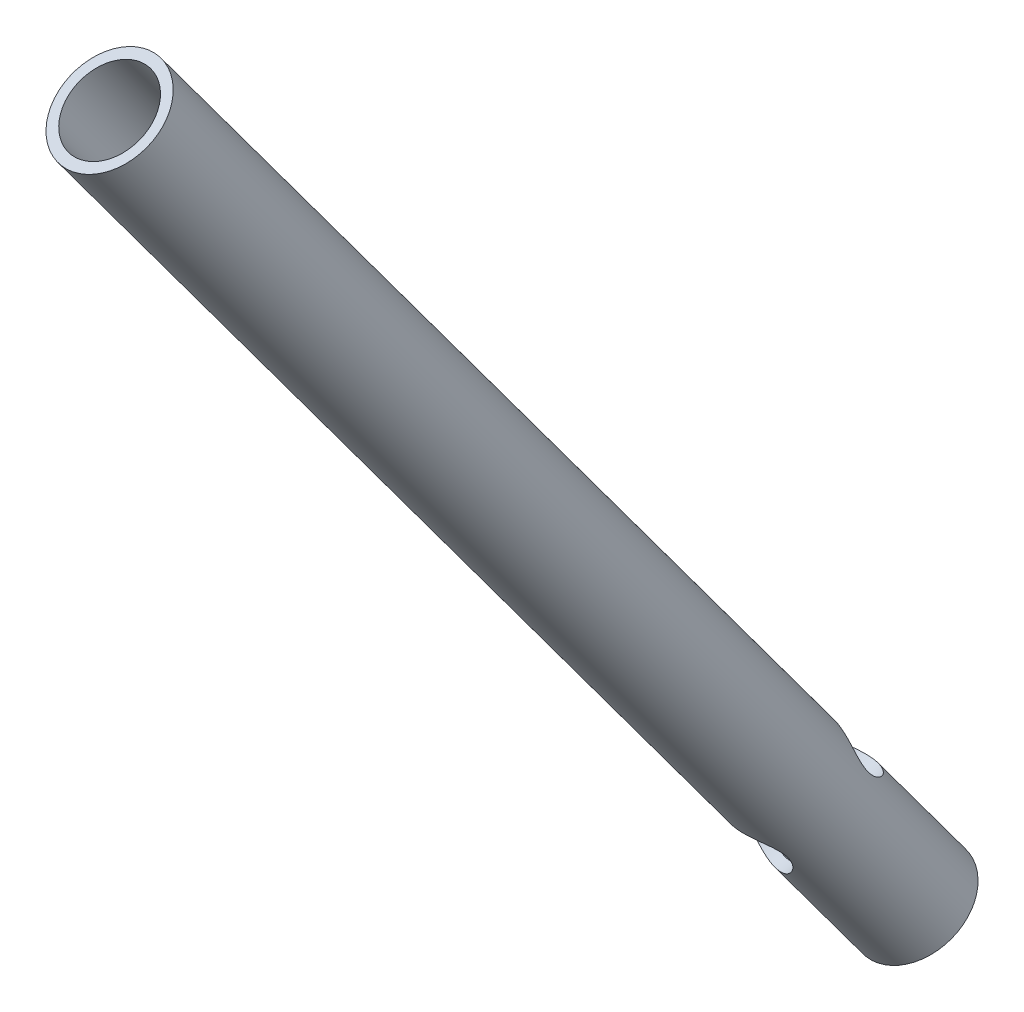
ISO-10303-21;
HEADER;
FILE_DESCRIPTION(('STEP AP214'),'2;1');
FILE_NAME('part.step','',(''),(''),'','','');
FILE_SCHEMA(('AUTOMOTIVE_DESIGN { 1 0 10303 214 1 1 1 1 }'));
ENDSEC;
DATA;
#1=APPLICATION_CONTEXT('core data for automotive mechanical design processes');
#2=APPLICATION_PROTOCOL_DEFINITION('international standard','automotive_design',2000,#1);
#3=PRODUCT_CONTEXT('',#1,'mechanical');
#4=PRODUCT('Part','Part','',(#3));
#5=PRODUCT_RELATED_PRODUCT_CATEGORY('part','',(#4));
#6=PRODUCT_DEFINITION_FORMATION('','',#4);
#7=PRODUCT_DEFINITION_CONTEXT('part definition',#1,'design');
#8=PRODUCT_DEFINITION('design','',#6,#7);
#9=PRODUCT_DEFINITION_SHAPE('','',#8);
#10=(LENGTH_UNIT() NAMED_UNIT(*) SI_UNIT(.MILLI.,.METRE.));
#11=(NAMED_UNIT(*) PLANE_ANGLE_UNIT() SI_UNIT($,.RADIAN.));
#12=(NAMED_UNIT(*) SI_UNIT($,.STERADIAN.) SOLID_ANGLE_UNIT());
#13=UNCERTAINTY_MEASURE_WITH_UNIT(LENGTH_MEASURE(1.E-05),#10,'distance_accuracy_value','');
#14=(GEOMETRIC_REPRESENTATION_CONTEXT(3) GLOBAL_UNCERTAINTY_ASSIGNED_CONTEXT((#13)) GLOBAL_UNIT_ASSIGNED_CONTEXT((#10,
#11,#12)) REPRESENTATION_CONTEXT('',''));
#15=CARTESIAN_POINT('',(0.,0.,0.));
#16=DIRECTION('',(0.,0.,1.));
#17=DIRECTION('',(1.,0.,0.));
#18=AXIS2_PLACEMENT_3D('',#15,#16,#17);
#19=CARTESIAN_POINT('',(63.0987415441482,49.4332995604528,122.83463270836));
#20=DIRECTION('',(-0.139606325522582,0.812953742443683,0.565346165212866));
#21=DIRECTION('',(0.,-0.57093730493495,0.820993662480787));
#22=AXIS2_PLACEMENT_3D('',#19,#20,#21);
#23=CYLINDRICAL_SURFACE('',#22,4.99999999999987);
#24=CARTESIAN_POINT('',(61.404673387767,56.4434887319872,133.799855613343));
#25=CARTESIAN_POINT('',(61.4828311919621,56.4734045881373,133.820659307766));
#26=CARTESIAN_POINT('',(61.5595057263382,56.5071017751196,133.84160121947));
#27=CARTESIAN_POINT('',(61.7093230524704,56.5814728077361,133.883786797185));
#28=CARTESIAN_POINT('',(61.782463968274,56.6221503080855,133.905030615897));
#29=CARTESIAN_POINT('',(61.9958000801327,56.7537121038821,133.969311099277));
#30=CARTESIAN_POINT('',(62.1300373785675,56.8541762756493,134.012930412775));
#31=CARTESIAN_POINT('',(62.3786503777988,57.0747367601084,134.102661861588));
#32=CARTESIAN_POINT('',(62.4931269495329,57.1947269014572,134.148759659744));
#33=CARTESIAN_POINT('',(62.7010789886567,57.4501472951768,134.245845167595));
#34=CARTESIAN_POINT('',(62.7945353431299,57.5855914320175,134.296837267886));
#35=CARTESIAN_POINT('',(62.9648642164375,57.8792424630439,134.411131033619));
#36=CARTESIAN_POINT('',(63.0396530525655,58.0384056169722,134.475110463413));
#37=CARTESIAN_POINT('',(63.157360684921,58.3625861834085,134.616088207033));
#38=CARTESIAN_POINT('',(63.2003473217564,58.5275903427886,134.693058375357));
#39=CARTESIAN_POINT('',(63.2437573350844,58.813021332251,134.841129762973));
#40=CARTESIAN_POINT('',(63.2522543212032,58.9340567375037,134.908697938559));
#41=CARTESIAN_POINT('',(63.2479757746082,59.1704837093475,135.052404422043));
#42=CARTESIAN_POINT('',(63.235221895459,59.2858808976982,135.128533932679));
#43=CARTESIAN_POINT('',(63.1885481595445,59.507401483483,135.287558283054));
#44=CARTESIAN_POINT('',(63.1546194008969,59.6135209591809,135.37045595537));
#45=CARTESIAN_POINT('',(63.0671517688983,59.8142048125803,135.539851190516));
#46=CARTESIAN_POINT('',(63.013596620492,59.9087595132257,135.626351688048));
#47=CARTESIAN_POINT('',(62.888078433766,60.0873320670051,135.800956127248));
#48=CARTESIAN_POINT('',(62.8157847733765,60.1711154083576,135.889059286522));
#49=CARTESIAN_POINT('',(62.6558025981993,60.3266478861921,136.061763788559));
#50=CARTESIAN_POINT('',(62.5681078172049,60.3983921010282,136.146363688581));
#51=CARTESIAN_POINT('',(62.3616480913652,60.5433721581661,136.324305822117));
#52=CARTESIAN_POINT('',(62.2401409253603,60.6143596739452,136.416307827502));
#53=CARTESIAN_POINT('',(61.9811240406226,60.7425275873673,136.586516239286));
#54=CARTESIAN_POINT('',(61.8435993884714,60.7996949450242,136.66470959796));
#55=CARTESIAN_POINT('',(61.5387739793861,60.9069571586091,136.810589584585));
#56=CARTESIAN_POINT('',(61.369863827551,60.9555350748461,136.876107729713));
#57=CARTESIAN_POINT('',(61.1076898163129,61.0167669103574,136.952764957039));
#58=CARTESIAN_POINT('',(61.0188011402721,61.0352423094892,136.974717518506));
#59=CARTESIAN_POINT('',(60.8387542406441,61.0683089268934,137.010752942468));
#60=CARTESIAN_POINT('',(60.747597539645,61.0829026779789,137.024840943293));
#61=CARTESIAN_POINT('',(60.5719017918832,61.1070598201668,137.043684875066));
#62=CARTESIAN_POINT('',(60.4874834834779,61.116952127489,137.049150869258));
#63=CARTESIAN_POINT('',(60.318208390448,61.1334299891546,137.052691228706));
#64=CARTESIAN_POINT('',(60.2333518779046,61.1400173925551,137.050769732407));
#65=CARTESIAN_POINT('',(60.0639973508861,61.1498534294813,137.039330855457));
#66=CARTESIAN_POINT('',(59.9794991576083,61.1531039898482,137.02981786412));
#67=CARTESIAN_POINT('',(59.8116780703698,61.1562562503289,137.003178131858));
#68=CARTESIAN_POINT('',(59.7283550463795,61.1561583238989,136.986052240209));
#69=CARTESIAN_POINT('',(59.5024133838283,61.1512886764345,136.928746106677));
#70=CARTESIAN_POINT('',(59.3617248873426,61.1430992010815,136.880890383541));
#71=CARTESIAN_POINT('',(59.0903999284307,61.1167122909284,136.764340861151));
#72=CARTESIAN_POINT('',(58.9597640068326,61.0985143181001,136.695645941731));
#73=CARTESIAN_POINT('',(58.7115637548257,61.0524491227678,136.540728363316));
#74=CARTESIAN_POINT('',(58.5939801482373,61.0245964164981,136.454532098362));
#75=CARTESIAN_POINT('',(58.3734313062693,60.9594304156756,136.268235572717));
#76=CARTESIAN_POINT('',(58.2704696129242,60.9221148348993,136.168131954666));
#77=CARTESIAN_POINT('',(58.0690045499671,60.8330835747857,135.945509670682));
#78=CARTESIAN_POINT('',(57.9724044584327,60.7801994687877,135.821737872367));
#79=CARTESIAN_POINT('',(57.7990191507332,60.6618951434585,135.566355958226));
#80=CARTESIAN_POINT('',(57.7222603460097,60.5964584145654,135.434735678738));
#81=CARTESIAN_POINT('',(57.5810904743679,60.4430970414093,135.152702560596));
#82=CARTESIAN_POINT('',(57.519272159567,60.3534148831814,135.001932319415));
#83=CARTESIAN_POINT('',(57.4223679917548,60.1544116207943,134.70485862279));
#84=CARTESIAN_POINT('',(57.3872380242176,60.0451232960129,134.558548181554));
#85=CARTESIAN_POINT('',(57.3502801035109,59.8344024067716,134.313387786523));
#86=CARTESIAN_POINT('',(57.3424616852154,59.7374380628691,134.211604863932));
#87=CARTESIAN_POINT('',(57.3436256163065,59.5321272950668,134.020442830854));
#88=CARTESIAN_POINT('',(57.3525871708231,59.42379511599,133.931048515012));
#89=CARTESIAN_POINT('',(57.3872534255522,59.197960872408,133.768035566651));
#90=CARTESIAN_POINT('',(57.4129910058861,59.0804411998142,133.694448292462));
#91=CARTESIAN_POINT('',(57.4803524992924,58.8403283596838,133.564873277239));
#92=CARTESIAN_POINT('',(57.5219882940875,58.717731458863,133.508898756519));
#93=CARTESIAN_POINT('',(57.6191123010293,58.4734540166422,133.41465098179));
#94=CARTESIAN_POINT('',(57.6744119174066,58.3517825073275,133.376155464376));
#95=CARTESIAN_POINT('',(57.7978686520831,58.1112881462758,133.313893343971));
#96=CARTESIAN_POINT('',(57.866030502835,57.9924663612434,133.290132176083));
#97=CARTESIAN_POINT('',(58.0272500609092,57.7402997831778,133.25202602937));
#98=CARTESIAN_POINT('',(58.1225768108131,57.6080453311155,133.24005194673));
#99=CARTESIAN_POINT('',(58.3286578776207,57.3554918836612,133.229935517004));
#100=CARTESIAN_POINT('',(58.4394269142802,57.2352044851063,133.231806456824));
#101=CARTESIAN_POINT('',(58.6921598863505,56.994800166459,133.247658685118));
#102=CARTESIAN_POINT('',(58.8363199213352,56.8770483585514,133.263293132649));
#103=CARTESIAN_POINT('',(59.0650687097398,56.7207298513272,133.294965426777));
#104=CARTESIAN_POINT('',(59.1434396207924,56.671991906227,133.306899889318));
#105=CARTESIAN_POINT('',(59.3039910836638,56.5820450536091,133.333147913492));
#106=CARTESIAN_POINT('',(59.3861692518347,56.5408315129874,133.347460000677));
#107=CARTESIAN_POINT('',(59.5485869544735,56.4690089463669,133.377150446031));
#108=CARTESIAN_POINT('',(59.6286273950489,56.4378986200845,133.392406512741));
#109=CARTESIAN_POINT('',(59.7910113144472,56.3835524455576,133.424408464987));
#110=CARTESIAN_POINT('',(59.87335348508,56.3603122190285,133.441153515605));
#111=CARTESIAN_POINT('',(60.0396498016595,56.3221772097682,133.475858425569));
#112=CARTESIAN_POINT('',(60.1236029543168,56.3072774453459,133.493817552558));
#113=CARTESIAN_POINT('',(60.2923842450794,56.286137721092,133.530704056181));
#114=CARTESIAN_POINT('',(60.377212335932,56.2798972960374,133.549631380742));
#115=CARTESIAN_POINT('',(60.542477938089,56.2763228489257,133.58722032221));
#116=CARTESIAN_POINT('',(60.6229145760324,56.2785429254547,133.605844650097));
#117=CARTESIAN_POINT('',(60.7830966049335,56.290867993634,133.643598610951));
#118=CARTESIAN_POINT('',(60.8628416983181,56.3009762243926,133.662728448378));
#119=CARTESIAN_POINT('',(61.0208728698429,56.3288876441332,133.701355817054));
#120=CARTESIAN_POINT('',(61.0991590439851,56.3466903249149,133.720853323939));
#121=CARTESIAN_POINT('',(61.2536419559188,56.3896668247694,133.760143421736));
#122=CARTESIAN_POINT('',(61.3298376017036,56.4148444189361,133.779936158834));
#123=CARTESIAN_POINT('',(61.404673387767,56.4434887319872,133.799855613343));
#124=B_SPLINE_CURVE_WITH_KNOTS('',3,(#24,#25,#26,#27,#28,#29,#30,#31,#32,#33,#34,#35,#36,#37,
#38,#39,#40,#41,#42,#43,#44,#45,#46,#47,#48,#49,#50,#51,#52,#53,#54,#55,#56,#57,#58,#59,#60,#61,
#62,#63,#64,#65,#66,#67,#68,#69,#70,#71,#72,#73,#74,#75,#76,#77,#78,#79,#80,#81,#82,#83,#84,#85,
#86,#87,#88,#89,#90,#91,#92,#93,#94,#95,#96,#97,#98,#99,#100,#101,#102,#103,#104,#105,#106,#107,
#108,#109,#110,#111,#112,#113,#114,#115,#116,#117,#118,#119,#120,#121,#122,#123),.UNSPECIFIED.,
.T.,.F.,(4,2,2,2,2,2,2,2,2,2,2,2,2,2,2,2,2,2,2,2,2,2,2,2,2,2,2,2,2,2,2,2,2,2,2,2,2,2,2,2,2,2,2,
2,2,2,2,2,2,4),(0.,0.258608279320157,0.517352374822459,1.03441949641947,1.54876367903651,
2.06357366224549,2.62212401424208,3.17947940086457,3.59429850369999,4.00869518512631,
4.42326619565079,4.83818176726183,5.26098594445673,5.68396254691969,6.1863428923063,
6.68919542370325,7.24856231562204,7.52842104361065,7.80809671056417,8.0632450002572,
8.31825037767569,8.57310842071175,8.82793803956181,9.27206020759358,9.71620625269517,
10.1596873844139,10.6032757630952,11.0983307210873,11.5940413096564,12.1493289033721,
12.7036966248454,13.124290136664,13.5443627656778,13.9652612005274,14.3864748165507,
14.8021709856753,15.2180204028114,15.7065350232686,16.1955185262623,16.7527225859344,
17.0315653949404,17.3102359249012,17.5715146474802,17.8326477760792,18.0936247650699,
18.3545877325269,18.6019919214398,18.8494977552841,19.0969872444468,19.3446036413598),.UNSPECIFIED.);
#125=CARTESIAN_POINT('',(61.404673387767,56.4434887319872,133.799855613343));
#126=VERTEX_POINT('',#125);
#127=EDGE_CURVE('E78',#126,#126,#124,.T.);
#128=ORIENTED_EDGE('',*,*,#127,.F.);
#129=EDGE_LOOP('',(#128));
#130=FACE_BOUND('',#129,.T.);
#131=CARTESIAN_POINT('',(61.881311059723,62.1091070245296,125.586073018601));
#132=CARTESIAN_POINT('',(61.8008724196494,62.113523137182,125.580053520732));
#133=CARTESIAN_POINT('',(61.7202314282759,62.1194477503574,125.577465026201));
#134=CARTESIAN_POINT('',(61.5592706168169,62.1342813586015,125.578981331433));
#135=CARTESIAN_POINT('',(61.4789510636016,62.1431924572031,125.583090856857));
#136=CARTESIAN_POINT('',(61.2390848714326,62.1744093759507,125.605122458262));
#137=CARTESIAN_POINT('',(61.0809024021429,62.2011839926366,125.63276612043));
#138=CARTESIAN_POINT('',(60.7739400841279,62.2661552197122,125.710403751037));
#139=CARTESIAN_POINT('',(60.6251061342224,62.3042769883001,125.760252301796));
#140=CARTESIAN_POINT('',(60.3386978614518,62.3921419678891,125.878406687382));
#141=CARTESIAN_POINT('',(60.2011229131129,62.4418845327249,125.946711495996));
#142=CARTESIAN_POINT('',(59.9265723053289,62.559249126142,126.105436954107));
#143=CARTESIAN_POINT('',(59.7910310020665,62.6281613022679,126.197385741739));
#144=CARTESIAN_POINT('',(59.5396344979326,62.7825491147967,126.393617547596));
#145=CARTESIAN_POINT('',(59.4237790283807,62.8680245251036,126.497900397448));
#146=CARTESIAN_POINT('',(59.2302965251827,63.0443179462219,126.697833844869));
#147=CARTESIAN_POINT('',(59.1495851698552,63.1326967600442,126.792637820258));
#148=CARTESIAN_POINT('',(59.0087311778158,63.324118364188,126.982669001316));
#149=CARTESIAN_POINT('',(58.9485613818948,63.4271415349189,127.077895478196));
#150=CARTESIAN_POINT('',(58.8515222519649,63.6480847290794,127.264785340055));
#151=CARTESIAN_POINT('',(58.8148181612262,63.7661035317424,127.356419281124));
#152=CARTESIAN_POINT('',(58.7674936525011,64.0132177659469,127.53108435887));
#153=CARTESIAN_POINT('',(58.7568682527375,64.1423110770628,127.614117135713));
#154=CARTESIAN_POINT('',(58.7612168285694,64.3917641889488,127.760860703859));
#155=CARTESIAN_POINT('',(58.773517368464,64.5115343731607,127.825691555835));
#156=CARTESIAN_POINT('',(58.8172067621712,64.7517966611108,127.946982174999));
#157=CARTESIAN_POINT('',(58.8486044554997,64.8722890735593,128.003438050594));
#158=CARTESIAN_POINT('',(58.9327263444859,65.1225356098714,128.114403370929));
#159=CARTESIAN_POINT('',(58.9872713620002,65.2520088591187,128.168151721914));
#160=CARTESIAN_POINT('',(59.115128367688,65.5041155570103,128.268985481622));
#161=CARTESIAN_POINT('',(59.1884532015189,65.6267442536789,128.316066295288));
#162=CARTESIAN_POINT('',(59.3676301216926,65.8843021563128,128.414060391438));
#163=CARTESIAN_POINT('',(59.4770135428551,66.0171548238435,128.464007661423));
#164=CARTESIAN_POINT('',(59.7174747067011,66.2635276342927,128.560098432386));
#165=CARTESIAN_POINT('',(59.8485630963128,66.3770382336308,128.606240049856));
#166=CARTESIAN_POINT('',(60.0611257249374,66.5299001164709,128.674538897579));
#167=CARTESIAN_POINT('',(60.1358162336042,66.5785128854679,128.697471859001));
#168=CARTESIAN_POINT('',(60.2896266149781,66.6683289226422,128.742935162468));
#169=CARTESIAN_POINT('',(60.3687441983748,66.7095359748379,128.765465704803));
#170=CARTESIAN_POINT('',(60.5307366121174,66.783767263674,128.810187214914));
#171=CARTESIAN_POINT('',(60.6136080758997,66.8167986670284,128.832378463985));
#172=CARTESIAN_POINT('',(60.7824234476615,66.87404916531,128.87643871763));
#173=CARTESIAN_POINT('',(60.8683667654497,66.8982699431223,128.898307782977));
#174=CARTESIAN_POINT('',(61.0309948101604,66.934791051015,128.938792441568));
#175=CARTESIAN_POINT('',(61.107410718548,66.9482401588824,128.957457669242));
#176=CARTESIAN_POINT('',(61.2612978942669,66.9678577857926,128.994396251112));
#177=CARTESIAN_POINT('',(61.338769507877,66.9740238548219,129.012669471408));
#178=CARTESIAN_POINT('',(61.4940153567944,66.9789520340745,129.048670955705));
#179=CARTESIAN_POINT('',(61.5717893123395,66.9777198558885,129.066399629481));
#180=CARTESIAN_POINT('',(61.727036895818,66.9679081302328,129.101165068672));
#181=CARTESIAN_POINT('',(61.8045104030238,66.9593258857867,129.118201577705));
#182=CARTESIAN_POINT('',(62.0219366804173,66.9249080379183,129.165071745163));
#183=CARTESIAN_POINT('',(62.1608605018996,66.8906871591935,129.193904153005));
#184=CARTESIAN_POINT('',(62.4320750073575,66.8002929480787,129.247396243387));
#185=CARTESIAN_POINT('',(62.5643648781663,66.7441169318885,129.272055415263));
#186=CARTESIAN_POINT('',(62.8269974788155,66.6090166276107,129.317096939597));
#187=CARTESIAN_POINT('',(62.9568367344637,66.5290149385538,129.337171082477));
#188=CARTESIAN_POINT('',(63.2048009925733,66.3512488848097,129.369555440143));
#189=CARTESIAN_POINT('',(63.3229180095437,66.2534725382399,129.381860392541));
#190=CARTESIAN_POINT('',(63.5615438958717,66.0293389060809,129.397808475496));
#191=CARTESIAN_POINT('',(63.6801975599911,65.9009033663516,129.400047700798));
#192=CARTESIAN_POINT('',(63.8999090492692,65.630313448841,129.388621234006));
#193=CARTESIAN_POINT('',(64.0009621989556,65.4881554413074,129.374951323129));
#194=CARTESIAN_POINT('',(64.1751355915328,65.2095496306107,129.329867620391));
#195=CARTESIAN_POINT('',(64.2500227026908,65.0739073980365,129.300323908769));
#196=CARTESIAN_POINT('',(64.3828799833466,64.799960030152,129.221567270284));
#197=CARTESIAN_POINT('',(64.4408696161183,64.6616581557299,129.172377129192));
#198=CARTESIAN_POINT('',(64.5139341800725,64.4558782479964,129.082023439526));
#199=CARTESIAN_POINT('',(64.5360406024137,64.3872406625383,129.048946206757));
#200=CARTESIAN_POINT('',(64.5752371637145,64.2514737254469,128.977225531349));
#201=CARTESIAN_POINT('',(64.5923298222333,64.1843436319726,128.938584899081));
#202=CARTESIAN_POINT('',(64.621302367269,64.052343285573,128.855907644814));
#203=CARTESIAN_POINT('',(64.6331837867728,63.9874723732421,128.811872614563));
#204=CARTESIAN_POINT('',(64.6516246919804,63.8606355697822,128.718830573558));
#205=CARTESIAN_POINT('',(64.6581846561562,63.7986694179474,128.669824010259));
#206=CARTESIAN_POINT('',(64.6687649879515,63.6340922139418,128.529968472966));
#207=CARTESIAN_POINT('',(64.6674372898349,63.534825384646,128.434686105201));
#208=CARTESIAN_POINT('',(64.6490271328631,63.3478419489293,128.234901339228));
#209=CARTESIAN_POINT('',(64.6319364396653,63.2601314067033,128.130394147921));
#210=CARTESIAN_POINT('',(64.5808859121334,63.0901366562365,127.908450049815));
#211=CARTESIAN_POINT('',(64.5457939853606,63.0087055154404,127.790624887154));
#212=CARTESIAN_POINT('',(64.4589995905014,62.8578709560249,127.55342267286));
#213=CARTESIAN_POINT('',(64.4072875248188,62.7884745227984,127.43404476288));
#214=CARTESIAN_POINT('',(64.2761125836219,62.6480950122376,127.174565458231));
#215=CARTESIAN_POINT('',(64.193210254821,62.5794226438464,127.034943399568));
#216=CARTESIAN_POINT('',(64.0047758860728,62.4560314739547,126.764798677052));
#217=CARTESIAN_POINT('',(63.8992288199598,62.4013219907196,126.634282131841));
#218=CARTESIAN_POINT('',(63.7215674615834,62.3280398495659,126.446776813718));
#219=CARTESIAN_POINT('',(63.6572298035963,62.304609024397,126.384191998548));
#220=CARTESIAN_POINT('',(63.5227632263208,62.2614638727826,126.264199158593));
#221=CARTESIAN_POINT('',(63.4526371836674,62.2417477160725,126.206788591702));
#222=CARTESIAN_POINT('',(63.3069638265701,62.2060665125806,126.098080243811));
#223=CARTESIAN_POINT('',(63.2314199719466,62.190099099208,126.046778616358));
#224=CARTESIAN_POINT('',(63.0754182164181,62.1619653285236,125.951145552333));
#225=CARTESIAN_POINT('',(62.9949619269647,62.1497977326616,125.906811846913));
#226=CARTESIAN_POINT('',(62.7819088171223,62.1234030046053,125.802477474536));
#227=CARTESIAN_POINT('',(62.646060855366,62.1120524941007,125.748238515618));
#228=CARTESIAN_POINT('',(62.3674030421206,62.0992563034031,125.661633948426));
#229=CARTESIAN_POINT('',(62.224611544358,62.0977858032859,125.62921371327));
#230=CARTESIAN_POINT('',(62.047428965599,62.102034394276,125.603234377735));
#231=CARTESIAN_POINT('',(62.0142785365967,62.1030872455637,125.598978917748));
#232=CARTESIAN_POINT('',(61.9478673092555,62.1057096128194,125.591644087762));
#233=CARTESIAN_POINT('',(61.9146065191996,62.1072790908434,125.588564631428));
#234=CARTESIAN_POINT('',(61.881311059723,62.1091070245296,125.586073018601));
#235=B_SPLINE_CURVE_WITH_KNOTS('',3,(#131,#132,#133,#134,#135,#136,#137,#138,#139,#140,#141,
#142,#143,#144,#145,#146,#147,#148,#149,#150,#151,#152,#153,#154,#155,#156,#157,#158,#159,#160,
#161,#162,#163,#164,#165,#166,#167,#168,#169,#170,#171,#172,#173,#174,#175,#176,#177,#178,#179,
#180,#181,#182,#183,#184,#185,#186,#187,#188,#189,#190,#191,#192,#193,#194,#195,#196,#197,#198,
#199,#200,#201,#202,#203,#204,#205,#206,#207,#208,#209,#210,#211,#212,#213,#214,#215,#216,#217,
#218,#219,#220,#221,#222,#223,#224,#225,#226,#227,#228,#229,#230,#231,#232,#233,#234),
.UNSPECIFIED.,.T.,.F.,(4,2,2,2,2,2,2,2,2,2,2,2,2,2,2,2,2,2,2,2,2,2,2,2,2,2,2,2,2,2,2,2,2,2,2,2,
2,2,2,2,2,2,2,2,2,2,2,2,2,2,2,4),(0.,0.242310536884075,0.484792105308223,0.97056184619206,
1.45319605841304,1.93580344052283,2.46664885901317,2.99748703172212,3.45371974236227,
3.90934688321991,4.36814815875293,4.8268617832737,5.23539149385452,5.64411044499283,
6.09375966965053,6.54371728593869,7.07899264158515,7.61453134774375,7.89025557154334,
8.16583850849858,8.44117900902505,8.71646689013167,8.95555091031055,9.1947153354439,
9.43369514474742,9.672762681044,10.1084883994221,10.5442673976635,11.00391380904,
11.4638712244673,11.9863179207073,12.508903190837,12.9802778147792,13.4511073223577,
13.688799085092,13.9263711954964,14.1638733725166,14.4013541924573,14.812163775326,
15.2231880803317,15.6639805945434,16.1050281110009,16.6317556187037,17.1588337292794,
17.436791318624,17.7146115944919,17.9922560072703,18.269809827191,18.7078367817332,
19.1447629404624,19.2450683796274,19.345366453466),.UNSPECIFIED.);
#236=CARTESIAN_POINT('',(61.881311059723,62.1091070245296,125.586073018601));
#237=VERTEX_POINT('',#236);
#238=EDGE_CURVE('E73',#237,#237,#235,.T.);
#239=ORIENTED_EDGE('',*,*,#238,.F.);
#240=EDGE_LOOP('',(#239));
#241=FACE_BOUND('',#240,.T.);
#242=CARTESIAN_POINT('',(63.0987415441482,49.4332995604528,122.83463270836));
#243=DIRECTION('',(-0.139606325522582,0.812953742443683,0.565346165212866));
#244=DIRECTION('',(0.,-0.57093730493495,0.820993662480786));
#245=AXIS2_PLACEMENT_3D('',#242,#243,#244);
#246=CIRCLE('',#245,4.99999999999987);
#247=CARTESIAN_POINT('',(63.0987415441482,46.5786130357781,126.939601020764));
#248=VERTEX_POINT('',#247);
#249=EDGE_CURVE('E10',#248,#248,#246,.T.);
#250=ORIENTED_EDGE('',*,*,#249,.T.);
#251=EDGE_LOOP('',(#250));
#252=FACE_BOUND('',#251,.T.);
#253=CARTESIAN_POINT('',(47.7420457366642,138.858211229258,185.022710881776));
#254=DIRECTION('',(-0.139606325522582,0.812953742443683,0.565346165212866));
#255=DIRECTION('',(0.,-0.57093730493495,0.820993662480786));
#256=AXIS2_PLACEMENT_3D('',#253,#254,#255);
#257=CIRCLE('',#256,4.99999999999987);
#258=CARTESIAN_POINT('',(47.7420457366642,136.003524704583,189.127679194179));
#259=VERTEX_POINT('',#258);
#260=EDGE_CURVE('E51',#259,#259,#257,.T.);
#261=ORIENTED_EDGE('',*,*,#260,.F.);
#262=EDGE_LOOP('',(#261));
#263=FACE_BOUND('',#262,.T.);
#264=ADVANCED_FACE('F33',(#130,#241,#252,#263),#23,.T.);
#265=CARTESIAN_POINT('',(63.0987415441482,49.4332995604528,122.83463270836));
#266=DIRECTION('',(-0.139606325522582,0.812953742443683,0.565346165212866));
#267=DIRECTION('',(0.,-0.57093730493495,0.820993662480786));
#268=AXIS2_PLACEMENT_3D('',#265,#266,#267);
#269=PLANE('',#268);
#270=CARTESIAN_POINT('',(63.0987415441482,49.4332995604528,122.83463270836));
#271=DIRECTION('',(-0.139606325522582,0.812953742443683,0.565346165212866));
#272=DIRECTION('',(0.,-0.57093730493495,0.820993662480786));
#273=AXIS2_PLACEMENT_3D('',#270,#271,#272);
#274=CIRCLE('',#273,4.);
#275=CARTESIAN_POINT('',(63.0987415441482,47.149550340713,126.118607358283));
#276=VERTEX_POINT('',#275);
#277=EDGE_CURVE('E46',#276,#276,#274,.T.);
#278=ORIENTED_EDGE('',*,*,#277,.T.);
#279=EDGE_LOOP('',(#278));
#280=FACE_BOUND('',#279,.T.);
#281=ORIENTED_EDGE('',*,*,#249,.F.);
#282=EDGE_LOOP('',(#281));
#283=FACE_BOUND('',#282,.T.);
#284=ADVANCED_FACE('F92',(#280,#283),#269,.F.);
#285=CARTESIAN_POINT('',(63.0987415441482,49.4332995604528,122.83463270836));
#286=DIRECTION('',(-0.139606325522582,0.812953742443683,0.565346165212866));
#287=DIRECTION('',(0.,-0.57093730493495,0.820993662480787));
#288=AXIS2_PLACEMENT_3D('',#285,#286,#287);
#289=CYLINDRICAL_SURFACE('',#288,4.);
#290=CARTESIAN_POINT('',(61.4115385942,56.9744486559441,132.951060788445));
#291=CARTESIAN_POINT('',(61.4889556001863,56.9995174489946,132.968490207977));
#292=CARTESIAN_POINT('',(61.5652160332129,57.0284925578144,132.985642560948));
#293=CARTESIAN_POINT('',(61.7147442596212,57.093653658811,133.019370423109));
#294=CARTESIAN_POINT('',(61.7880094057848,57.1298458702164,133.035945420199));
#295=CARTESIAN_POINT('',(62.0029549037653,57.2485086103537,133.084963003137));
#296=CARTESIAN_POINT('',(62.1394292056239,57.3409459917894,133.116619386445));
#297=CARTESIAN_POINT('',(62.3942621823752,57.5457492269705,133.178533409848));
#298=CARTESIAN_POINT('',(62.5127790345182,57.6579196560515,133.208801398348));
#299=CARTESIAN_POINT('',(62.7320944980042,57.8982735917463,133.27018113296));
#300=CARTESIAN_POINT('',(62.8328874738685,58.0264621694039,133.301293143822));
#301=CARTESIAN_POINT('',(62.9769607511545,58.238211792728,133.353216897061));
#302=CARTESIAN_POINT('',(63.0265867345717,58.3178349587032,133.372849272478));
#303=CARTESIAN_POINT('',(63.119201313684,58.4804322338967,133.414039649275));
#304=CARTESIAN_POINT('',(63.1621881006072,58.5634072485471,133.435598172895));
#305=CARTESIAN_POINT('',(63.241035423469,58.7318455130084,133.481454988536));
#306=CARTESIAN_POINT('',(63.2769035594806,58.817305996237,133.505750314737));
#307=CARTESIAN_POINT('',(63.3409852501269,58.9899242254842,133.55809553725));
#308=CARTESIAN_POINT('',(63.3692000180891,59.0770817001189,133.586144837371));
#309=CARTESIAN_POINT('',(63.4248206536753,59.279765450619,133.656794526816));
#310=CARTESIAN_POINT('',(63.4491527957341,59.3955520687822,133.701192050251));
#311=CARTESIAN_POINT('',(63.4810598618581,59.6245943232754,133.800856119255));
#312=CARTESIAN_POINT('',(63.4886731778622,59.7378551658376,133.856097445144));
#313=CARTESIAN_POINT('',(63.4853926846169,59.958499703309,133.979258961492));
#314=CARTESIAN_POINT('',(63.4743315013546,60.0658212477184,134.047288908264));
#315=CARTESIAN_POINT('',(63.433215607361,60.2689117169034,134.194048096366));
#316=CARTESIAN_POINT('',(63.4031543351639,60.364676637118,134.272781026476));
#317=CARTESIAN_POINT('',(63.330204803972,60.5329882118344,134.427969131445));
#318=CARTESIAN_POINT('',(63.2890396229401,60.6069237051249,134.503761750436));
#319=CARTESIAN_POINT('',(63.1951181160616,60.7444543840929,134.657498939366));
#320=CARTESIAN_POINT('',(63.1423506100837,60.8080394924612,134.735445521109));
#321=CARTESIAN_POINT('',(62.99083898618,60.9630768171021,134.939446157874));
#322=CARTESIAN_POINT('',(62.8839740581012,61.0471021926819,135.065113909196));
#323=CARTESIAN_POINT('',(62.6488903637062,61.1971263862273,135.307074683712));
#324=CARTESIAN_POINT('',(62.5206199823131,61.2630805882006,135.423344013455));
#325=CARTESIAN_POINT('',(62.2419928723287,61.3822689661736,135.642806328861));
#326=CARTESIAN_POINT('',(62.0911607799894,61.4351404626747,135.745595658383));
#327=CARTESIAN_POINT('',(61.7725053138278,61.5279983250513,135.927718520181));
#328=CARTESIAN_POINT('',(61.6047152879118,61.5680093571635,136.007096929947));
#329=CARTESIAN_POINT('',(61.2904795147625,61.6290056362713,136.122616397978));
#330=CARTESIAN_POINT('',(61.1464829657036,61.6521960239428,136.164231407028));
#331=CARTESIAN_POINT('',(60.8526605180004,61.6905548687815,136.224416665661));
#332=CARTESIAN_POINT('',(60.7028383310028,61.705728346629,136.243001348084));
#333=CARTESIAN_POINT('',(60.4005847316449,61.7277773339263,136.254311179165));
#334=CARTESIAN_POINT('',(60.2481429630444,61.7346014993596,136.246877395579));
#335=CARTESIAN_POINT('',(59.9469589761489,61.7395213753289,136.204630692206));
#336=CARTESIAN_POINT('',(59.7982152153986,61.7376207885601,136.169829392107));
#337=CARTESIAN_POINT('',(59.5243749872222,61.7258054104296,136.079030819663));
#338=CARTESIAN_POINT('',(59.3984058004725,61.7167172261782,136.025521904531));
#339=CARTESIAN_POINT('',(59.1568710760685,61.6918185741306,135.899901055347));
#340=CARTESIAN_POINT('',(59.0413077525026,61.6760066797855,135.827785174789));
#341=CARTESIAN_POINT('',(58.8187905517565,61.6373177570483,135.665361192851));
#342=CARTESIAN_POINT('',(58.7122807909483,61.6142123832917,135.574503745742));
#343=CARTESIAN_POINT('',(58.5136255325839,61.5613871417209,135.380039097331));
#344=CARTESIAN_POINT('',(58.4214820292061,61.5316663570099,135.276430129559));
#345=CARTESIAN_POINT('',(58.2375697376828,61.4600293189738,135.041826175184));
#346=CARTESIAN_POINT('',(58.1484299508719,61.4169055509493,134.909146494743));
#347=CARTESIAN_POINT('',(57.9894345212993,61.3206400058556,134.635712721038));
#348=CARTESIAN_POINT('',(57.9196225538308,61.2674759890801,134.494941194837));
#349=CARTESIAN_POINT('',(57.8235165727311,61.1731899385528,134.267922203952));
#350=CARTESIAN_POINT('',(57.7910420856003,61.1358953629769,134.182652312288));
#351=CARTESIAN_POINT('',(57.7328379792872,61.0564465051973,134.012078560249));
#352=CARTESIAN_POINT('',(57.7071108323278,61.0142904498714,133.926774698861));
#353=CARTESIAN_POINT('',(57.640278054223,60.879533196945,133.672982564642));
#354=CARTESIAN_POINT('',(57.6092291437883,60.7783700381553,133.505907793193));
#355=CARTESIAN_POINT('',(57.5824573696517,60.5916743720562,133.251697892821));
#356=CARTESIAN_POINT('',(57.5776955934202,60.5153439063673,133.158727752035));
#357=CARTESIAN_POINT('',(57.5794551487036,60.3509130922867,132.984088600271));
#358=CARTESIAN_POINT('',(57.5859511957553,60.2628395282045,132.902394708202));
#359=CARTESIAN_POINT('',(57.6103678539485,60.0755588642807,132.753845834065));
#360=CARTESIAN_POINT('',(57.6283463778953,59.9762974395854,132.687068402114));
#361=CARTESIAN_POINT('',(57.6751590356934,59.7703931231291,132.570846662709));
#362=CARTESIAN_POINT('',(57.7040070780939,59.6637409174848,132.521424720411));
#363=CARTESIAN_POINT('',(57.7788159699486,59.4238094736031,132.430160601552));
#364=CARTESIAN_POINT('',(57.8271332170472,59.2897800879147,132.392298978665));
#365=CARTESIAN_POINT('',(57.9367345753429,59.022810735913,132.336231901704));
#366=CARTESIAN_POINT('',(57.9980512773394,58.8898743967942,132.318076566593));
#367=CARTESIAN_POINT('',(58.1108170310125,58.6717049057736,132.300136704474));
#368=CARTESIAN_POINT('',(58.1589748725787,58.5850375511725,132.296294601988));
#369=CARTESIAN_POINT('',(58.2607423199841,58.4148913641874,132.294184448944));
#370=CARTESIAN_POINT('',(58.3143516385935,58.3314123641325,132.295916104862));
#371=CARTESIAN_POINT('',(58.4270636546283,58.1683777127559,132.30398127844));
#372=CARTESIAN_POINT('',(58.4861713790467,58.0888257555235,132.310319044084));
#373=CARTESIAN_POINT('',(58.6098709705993,57.9345139637522,132.326823516574));
#374=CARTESIAN_POINT('',(58.674463106345,57.8597543642448,132.336990411044));
#375=CARTESIAN_POINT('',(58.8097339557676,57.7152504078829,132.360621006457));
#376=CARTESIAN_POINT('',(58.8804612654031,57.6455560207136,132.374112954706));
#377=CARTESIAN_POINT('',(59.027435420327,57.5128945604107,132.403790949518));
#378=CARTESIAN_POINT('',(59.1036811123799,57.4499260884615,132.419976434098));
#379=CARTESIAN_POINT('',(59.2613555149284,57.3318958878033,132.454513697954));
#380=CARTESIAN_POINT('',(59.34277179813,57.2768161649527,132.472860367424));
#381=CARTESIAN_POINT('',(59.510522707112,57.1755495202175,132.511275286574));
#382=CARTESIAN_POINT('',(59.596854958279,57.1293583512356,132.531342707391));
#383=CARTESIAN_POINT('',(59.8106362581416,57.0299048242614,132.581347638885));
#384=CARTESIAN_POINT('',(59.940315342722,56.9816271656159,132.611932931666));
#385=CARTESIAN_POINT('',(60.2057815674682,56.9080489178484,132.674360934549));
#386=CARTESIAN_POINT('',(60.341567593292,56.8827441545402,132.706203415121));
#387=CARTESIAN_POINT('',(60.6159958351309,56.8568590176327,132.770017272197));
#388=CARTESIAN_POINT('',(60.7546466832467,56.8563694392287,132.801988694056));
#389=CARTESIAN_POINT('',(61.029771066879,56.8804785053769,132.864863504429));
#390=CARTESIAN_POINT('',(61.1662485219827,56.9050251152352,132.895768970663));
#391=CARTESIAN_POINT('',(61.3371187115918,56.9513322862803,132.934302305968));
#392=CARTESIAN_POINT('',(61.3744612965394,56.9624424682844,132.942713323082));
#393=CARTESIAN_POINT('',(61.4115385942,56.9744486559441,132.951060788445));
#394=B_SPLINE_CURVE_WITH_KNOTS('',3,(#290,#291,#292,#293,#294,#295,#296,#297,#298,#299,#300,
#301,#302,#303,#304,#305,#306,#307,#308,#309,#310,#311,#312,#313,#314,#315,#316,#317,#318,#319,
#320,#321,#322,#323,#324,#325,#326,#327,#328,#329,#330,#331,#332,#333,#334,#335,#336,#337,#338,
#339,#340,#341,#342,#343,#344,#345,#346,#347,#348,#349,#350,#351,#352,#353,#354,#355,#356,#357,
#358,#359,#360,#361,#362,#363,#364,#365,#366,#367,#368,#369,#370,#371,#372,#373,#374,#375,#376,
#377,#378,#379,#380,#381,#382,#383,#384,#385,#386,#387,#388,#389,#390,#391,#392,#393),
.UNSPECIFIED.,.T.,.F.,(4,2,2,2,2,2,2,2,2,2,2,2,2,2,2,2,2,2,2,2,2,2,2,2,2,2,2,2,2,2,2,2,2,2,2,2,
2,2,2,2,2,2,2,2,2,2,2,2,2,2,2,4),(0.,0.249635799974118,0.499487656739636,1.00032556082771,
1.49645722391781,1.99274635276699,2.28005230653701,2.56743639592911,2.85451199563287,
3.14154205713683,3.51928438362886,3.8961583780991,4.27642814399656,4.6568293035607,
4.99640082750925,5.33630101173456,5.88867733142098,6.44240537221636,7.01009603172975,
7.57669127767298,8.02988763737091,8.48279984029196,8.93848344608082,9.39397368231261,
9.80357957096063,10.2132724078211,10.6373344271123,11.0614552580919,11.5563584208329,
12.0523709597289,12.3477507418182,12.6432386002233,13.2318091317035,13.5916661233065,
13.950715942596,14.3115911150606,14.672929637444,15.1127845530593,15.5537555483811,
15.8510935221141,16.1484158376833,16.4460127071749,16.7436241605588,17.0438567647721,
17.3440268063354,17.6435008705103,17.942831483786,18.3660387767135,18.7891691572705,
19.2138475997498,19.6376451943798,19.757203174496),.UNSPECIFIED.);
#395=CARTESIAN_POINT('',(61.4115385942,56.9744486559441,132.951060788445));
#396=VERTEX_POINT('',#395);
#397=EDGE_CURVE('E37',#396,#396,#394,.T.);
#398=ORIENTED_EDGE('',*,*,#397,.T.);
#399=EDGE_LOOP('',(#398));
#400=FACE_BOUND('',#399,.T.);
#401=CARTESIAN_POINT('',(61.7045380835592,61.5242359008442,126.383450927804));
#402=CARTESIAN_POINT('',(61.6260353308223,61.527556575862,126.378924589918));
#403=CARTESIAN_POINT('',(61.5473717074172,61.5320320451272,126.378011339926));
#404=CARTESIAN_POINT('',(61.3904251279751,61.5432510693846,126.383181844976));
#405=CARTESIAN_POINT('',(61.3121423840496,61.5499957677,126.389269130898));
#406=CARTESIAN_POINT('',(61.078583020341,61.5735940796281,126.417588106018));
#407=CARTESIAN_POINT('',(60.9247688062958,61.593804521541,126.449885523047));
#408=CARTESIAN_POINT('',(60.6267542394458,61.6425849696944,126.537118394891));
#409=CARTESIAN_POINT('',(60.4824861255064,61.6710859611067,126.591868425622));
#410=CARTESIAN_POINT('',(60.2045548676246,61.7365317276083,126.719861737491));
#411=CARTESIAN_POINT('',(60.070892099609,61.7734768018344,126.793105673796));
#412=CARTESIAN_POINT('',(59.7978583114816,61.8622394304968,126.965484445686));
#413=CARTESIAN_POINT('',(59.6603179026783,61.9154164273697,127.066810109592));
#414=CARTESIAN_POINT('',(59.4029785681996,62.0357819016613,127.283019546661));
#415=CARTESIAN_POINT('',(59.283190819629,62.1029791426905,127.397911780267));
#416=CARTESIAN_POINT('',(59.0826894298585,62.2425039656299,127.615250156797));
#417=CARTESIAN_POINT('',(58.9987928887381,62.3120582742795,127.716530537297));
#418=CARTESIAN_POINT('',(58.8480177150449,62.4667349152678,127.91983481277));
#419=CARTESIAN_POINT('',(58.7811017629871,62.551822388437,128.021856561344));
#420=CARTESIAN_POINT('',(58.6800914944413,62.7202507294741,128.199593446748));
#421=CARTESIAN_POINT('',(58.6420465436091,62.8001383376015,128.276300631497));
#422=CARTESIAN_POINT('',(58.5809962914269,62.9710658452775,128.422908622045));
#423=CARTESIAN_POINT('',(58.5579701194913,63.0620900591007,128.492818757712));
#424=CARTESIAN_POINT('',(58.5280384042387,63.2532583061814,128.623195096893));
#425=CARTESIAN_POINT('',(58.5211519013758,63.3534129664039,128.683650067511));
#426=CARTESIAN_POINT('',(58.5231102208701,63.5591608149001,128.794250868535));
#427=CARTESIAN_POINT('',(58.5319785858913,63.6647619128422,128.844381145704));
#428=CARTESIAN_POINT('',(58.5695060445,63.9146858166186,128.951172233294));
#429=CARTESIAN_POINT('',(58.6039688504722,64.0597191742175,129.004054373394));
#430=CARTESIAN_POINT('',(58.6947656082775,64.3468769686428,129.098031200405));
#431=CARTESIAN_POINT('',(58.7511608323393,64.4889920713535,129.139092298825));
#432=CARTESIAN_POINT('',(58.8590010938306,64.7155778121134,129.200330828005));
#433=CARTESIAN_POINT('',(58.9047915285088,64.8022212246145,129.22267338751));
#434=CARTESIAN_POINT('',(59.0036479702669,64.9717782644376,129.265355291075));
#435=CARTESIAN_POINT('',(59.0567160369806,65.0546908270426,129.285694065236));
#436=CARTESIAN_POINT('',(59.2262330909235,65.2964216528161,129.344884092937));
#437=CARTESIAN_POINT('',(59.3531571847201,65.4485747084921,129.381993270722));
#438=CARTESIAN_POINT('',(59.6079162342346,65.7027872498465,129.44947622688));
#439=CARTESIAN_POINT('',(59.7316745899614,65.8089512582971,129.479888064619));
#440=CARTESIAN_POINT('',(59.9950818727652,65.9991418642131,129.542200868466));
#441=CARTESIAN_POINT('',(60.1347190365853,66.0831846983395,129.57410072203));
#442=CARTESIAN_POINT('',(60.3542982311638,66.1889537872591,129.623779267657));
#443=CARTESIAN_POINT('',(60.4295967028009,66.2209399853363,129.640736551308));
#444=CARTESIAN_POINT('',(60.5828455793121,66.2772999692746,129.675233734391));
#445=CARTESIAN_POINT('',(60.6607945039065,66.3016779293459,129.692773308487));
#446=CARTESIAN_POINT('',(60.8186258569273,66.3422761989227,129.728386312354));
#447=CARTESIAN_POINT('',(60.8985070620656,66.3585015349889,129.746459405884));
#448=CARTESIAN_POINT('',(61.0594067586727,66.382447286052,129.783030024568));
#449=CARTESIAN_POINT('',(61.1404250471154,66.3901692002512,129.80152747432));
#450=CARTESIAN_POINT('',(61.3593299539452,66.3992303478274,129.851780217928));
#451=CARTESIAN_POINT('',(61.4975795630577,66.392395565064,129.883809031482));
#452=CARTESIAN_POINT('',(61.7705972089617,66.3541580916621,129.94753447292));
#453=CARTESIAN_POINT('',(61.9053652463249,66.3227554050583,129.979231100858));
#454=CARTESIAN_POINT('',(62.164091904475,66.238863915185,130.040115580155));
#455=CARTESIAN_POINT('',(62.2882516346234,66.1870206073422,130.069349747664));
#456=CARTESIAN_POINT('',(62.5278380526937,66.0651071475394,130.125122723431));
#457=CARTESIAN_POINT('',(62.643263208006,65.9950338063806,130.151661058944));
#458=CARTESIAN_POINT('',(62.8787207909733,65.8293988851477,130.204107349869));
#459=CARTESIAN_POINT('',(62.9973618412283,65.73169697864,130.229473126542));
#460=CARTESIAN_POINT('',(63.2213326266812,65.5206545553826,130.273433895076));
#461=CARTESIAN_POINT('',(63.3266459499094,65.4072951099526,130.292020591045));
#462=CARTESIAN_POINT('',(63.5435584334492,65.1444880739053,130.322998776475));
#463=CARTESIAN_POINT('',(63.652198232261,64.9923582651114,130.333406237375));
#464=CARTESIAN_POINT('',(63.8502299442549,64.6757904096187,130.335794035781));
#465=CARTESIAN_POINT('',(63.9396281120511,64.5113563859761,130.327780371114));
#466=CARTESIAN_POINT('',(64.076239304432,64.2233511908525,130.291050280586));
#467=CARTESIAN_POINT('',(64.1282519403059,64.1012521579194,130.26876975932));
#468=CARTESIAN_POINT('',(64.2211023693295,63.8574056568048,130.206447217663));
#469=CARTESIAN_POINT('',(64.2619665651344,63.735658045653,130.166447761248));
#470=CARTESIAN_POINT('',(64.3262034747655,63.5147122520264,130.072867504588));
#471=CARTESIAN_POINT('',(64.351259125031,63.4148175896951,130.022123305722));
#472=CARTESIAN_POINT('',(64.3914215178787,63.2223886680931,129.905138715257));
#473=CARTESIAN_POINT('',(64.4065346205175,63.1298497368799,129.838908266741));
#474=CARTESIAN_POINT('',(64.4263731275933,62.9549915447711,129.693290297475));
#475=CARTESIAN_POINT('',(64.4311230962823,62.8726485543145,129.613934370558));
#476=CARTESIAN_POINT('',(64.4304840213058,62.7185851986746,129.445494177419));
#477=CARTESIAN_POINT('',(64.4250789166358,62.6468818544257,129.356394710984));
#478=CARTESIAN_POINT('',(64.3996225893494,62.4814068543951,129.128005014351));
#479=CARTESIAN_POINT('',(64.3737951920705,62.3935202857601,128.985119587864));
#480=CARTESIAN_POINT('',(64.30199379307,62.234819013535,128.694978905948));
#481=CARTESIAN_POINT('',(64.2559751755481,62.1640426579905,128.547714650407));
#482=CARTESIAN_POINT('',(64.1420600512079,62.0334903553549,128.249891672268));
#483=CARTESIAN_POINT('',(64.0734540207704,61.9741862692418,128.099398106074));
#484=CARTESIAN_POINT('',(63.9145184298958,61.8671696594549,127.806088414975));
#485=CARTESIAN_POINT('',(63.8242117902688,61.8194450114261,127.663264382737));
#486=CARTESIAN_POINT('',(63.6283676527274,61.737228869246,127.400265602075));
#487=CARTESIAN_POINT('',(63.5243117628995,61.702051329605,127.279207961014));
#488=CARTESIAN_POINT('',(63.2969518427025,61.6404457233459,127.053717572234));
#489=CARTESIAN_POINT('',(63.1736491041254,61.6140170698994,126.949283709725));
#490=CARTESIAN_POINT('',(62.9751307102751,61.5811488046442,126.809086316034));
#491=CARTESIAN_POINT('',(62.9063044770279,61.5712886527176,126.764910624484));
#492=CARTESIAN_POINT('',(62.7646630571793,61.553971853304,126.682977156311));
#493=CARTESIAN_POINT('',(62.6918500889465,61.5465138847389,126.645215857519));
#494=CARTESIAN_POINT('',(62.5429149481099,61.5340769635016,126.576791570531));
#495=CARTESIAN_POINT('',(62.4667988816869,61.5290936320547,126.546116096074));
#496=CARTESIAN_POINT('',(62.3118736110335,61.5216396462174,126.492281801451));
#497=CARTESIAN_POINT('',(62.2330659273019,61.5191675966946,126.46911881263));
#498=CARTESIAN_POINT('',(62.0796862305291,61.5168519558879,126.43209114885));
#499=CARTESIAN_POINT('',(62.0052562326357,61.5168203712411,126.417647177282));
#500=CARTESIAN_POINT('',(61.855446365686,61.5189151157259,126.395505136873));
#501=CARTESIAN_POINT('',(61.7800666806627,61.5210410329347,126.387805780834));
#502=CARTESIAN_POINT('',(61.7045380835592,61.5242359008442,126.383450927804));
#503=B_SPLINE_CURVE_WITH_KNOTS('',3,(#401,#402,#403,#404,#405,#406,#407,#408,#409,#410,#411,
#412,#413,#414,#415,#416,#417,#418,#419,#420,#421,#422,#423,#424,#425,#426,#427,#428,#429,#430,
#431,#432,#433,#434,#435,#436,#437,#438,#439,#440,#441,#442,#443,#444,#445,#446,#447,#448,#449,
#450,#451,#452,#453,#454,#455,#456,#457,#458,#459,#460,#461,#462,#463,#464,#465,#466,#467,#468,
#469,#470,#471,#472,#473,#474,#475,#476,#477,#478,#479,#480,#481,#482,#483,#484,#485,#486,#487,
#488,#489,#490,#491,#492,#493,#494,#495,#496,#497,#498,#499,#500,#501,#502),.UNSPECIFIED.,.T.,
.F.,(4,2,2,2,2,2,2,2,2,2,2,2,2,2,2,2,2,2,2,2,2,2,2,2,2,2,2,2,2,2,2,2,2,2,2,2,2,2,2,2,2,2,2,2,2,
2,2,2,2,2,4),(0.,0.236018111287856,0.4721553159193,0.944943616401379,1.41390361881474,
1.88288023699755,2.41766089835203,2.9527768410184,3.39770783270343,3.84165232843314,
4.19148875547716,4.54083799676126,4.8905991688692,5.2408834324655,5.71282323276816,
6.18609106560006,6.48729495963252,6.78858427359962,7.39001409467315,7.88579446859414,
8.38120992481285,8.63153322076301,8.88171893605108,9.13175020762209,9.38173739018108,
9.80558504291178,10.2294326260372,10.6408482881917,11.052335972687,11.5179546273555,
11.9841411854703,12.5436170164832,13.1029107107595,13.5053610796925,13.9068498912379,
14.2497039060088,14.5923383898553,14.9341598237214,15.2765223287655,15.7829067333309,
16.2904157568438,16.8156922289047,17.340416308767,17.828920616259,18.3173921508616,
18.5642005701065,18.8108730246509,19.0571074325476,19.3032049709995,19.5303246539535,
19.7574009820449),.UNSPECIFIED.);
#504=CARTESIAN_POINT('',(61.7045380835592,61.5242359008442,126.383450927804));
#505=VERTEX_POINT('',#504);
#506=EDGE_CURVE('E54',#505,#505,#503,.T.);
#507=ORIENTED_EDGE('',*,*,#506,.T.);
#508=EDGE_LOOP('',(#507));
#509=FACE_BOUND('',#508,.T.);
#510=ORIENTED_EDGE('',*,*,#277,.F.);
#511=EDGE_LOOP('',(#510));
#512=FACE_BOUND('',#511,.T.);
#513=CARTESIAN_POINT('',(47.7420457366642,138.858211229258,185.022710881776));
#514=DIRECTION('',(-0.139606325522582,0.812953742443683,0.565346165212866));
#515=DIRECTION('',(0.,-0.57093730493495,0.820993662480786));
#516=AXIS2_PLACEMENT_3D('',#513,#514,#515);
#517=CIRCLE('',#516,4.);
#518=CARTESIAN_POINT('',(47.7420457366642,136.574462009518,188.306685531699));
#519=VERTEX_POINT('',#518);
#520=EDGE_CURVE('E84',#519,#519,#517,.T.);
#521=ORIENTED_EDGE('',*,*,#520,.T.);
#522=EDGE_LOOP('',(#521));
#523=FACE_BOUND('',#522,.T.);
#524=ADVANCED_FACE('F59',(#400,#509,#512,#523),#289,.F.);
#525=CARTESIAN_POINT('',(47.7420457366642,138.858211229258,185.022710881776));
#526=DIRECTION('',(-0.139606325522582,0.812953742443683,0.565346165212866));
#527=DIRECTION('',(0.,-0.57093730493495,0.820993662480786));
#528=AXIS2_PLACEMENT_3D('',#525,#526,#527);
#529=PLANE('',#528);
#530=ORIENTED_EDGE('',*,*,#260,.T.);
#531=EDGE_LOOP('',(#530));
#532=FACE_BOUND('',#531,.T.);
#533=ORIENTED_EDGE('',*,*,#520,.F.);
#534=EDGE_LOOP('',(#533));
#535=FACE_BOUND('',#534,.T.);
#536=ADVANCED_FACE('F67',(#532,#535),#529,.T.);
#537=CARTESIAN_POINT('',(71.1942411185942,95.3409010743917,85.3521577002681));
#538=DIRECTION('',(-0.175971103848523,-0.58221804869482,0.793760867254319));
#539=DIRECTION('',(0.,-0.806343590896352,-0.591447388548108));
#540=AXIS2_PLACEMENT_3D('',#537,#538,#539);
#541=CYLINDRICAL_SURFACE('',#540,3.);
#542=ORIENTED_EDGE('',*,*,#238,.T.);
#543=EDGE_LOOP('',(#542));
#544=FACE_BOUND('',#543,.T.);
#545=ORIENTED_EDGE('',*,*,#506,.F.);
#546=EDGE_LOOP('',(#545));
#547=FACE_BOUND('',#546,.T.);
#548=ADVANCED_FACE('F65',(#544,#547),#541,.F.);
#549=ORIENTED_EDGE('',*,*,#127,.T.);
#550=EDGE_LOOP('',(#549));
#551=FACE_BOUND('',#550,.T.);
#552=ORIENTED_EDGE('',*,*,#397,.F.);
#553=EDGE_LOOP('',(#552));
#554=FACE_BOUND('',#553,.T.);
#555=ADVANCED_FACE('F62',(#551,#554),#541,.F.);
#556=CLOSED_SHELL('',(#264,#284,#524,#536,#548,#555));
#557=MANIFOLD_SOLID_BREP('B2',#556);
#558=ADVANCED_BREP_SHAPE_REPRESENTATION('',(#18,#557),#14);
#559=SHAPE_DEFINITION_REPRESENTATION(#9,#558);
ENDSEC;
END-ISO-10303-21;
